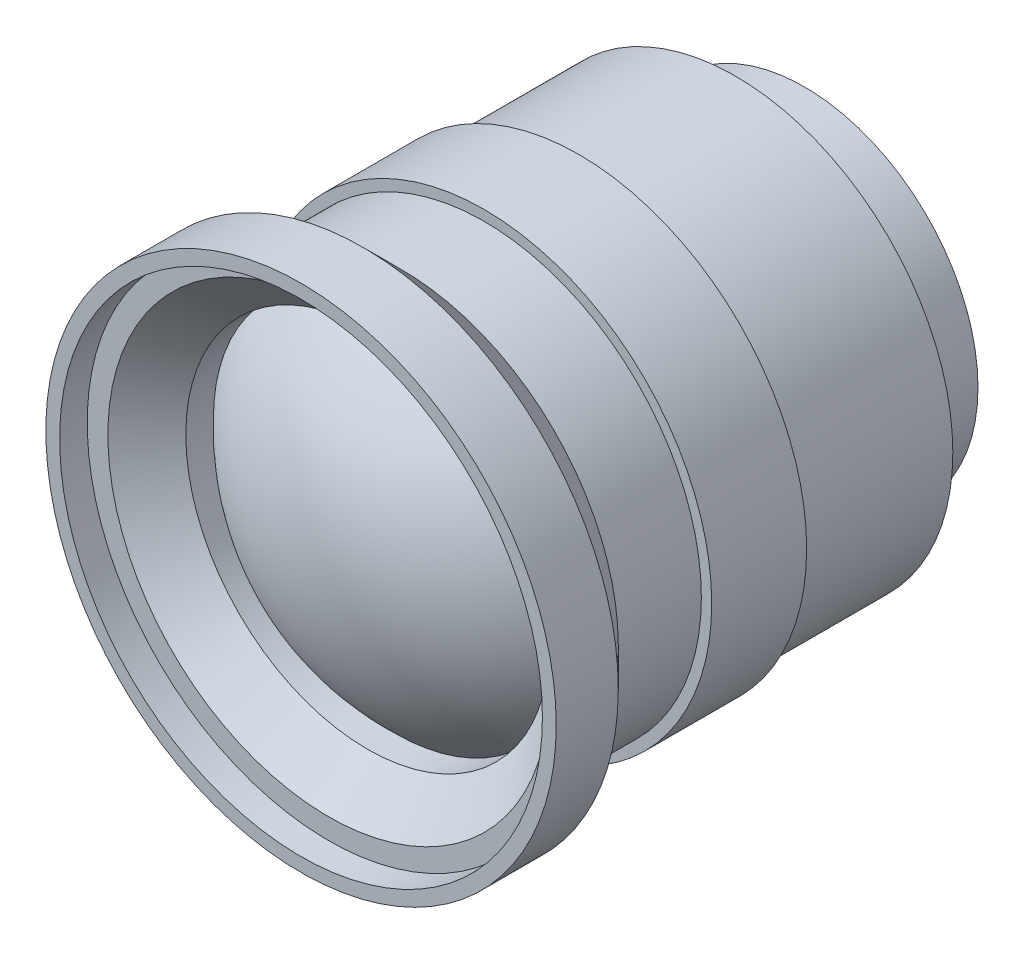
ISO-10303-21;
HEADER;
FILE_DESCRIPTION(('STEP AP214'),'2;1');
FILE_NAME('part.step','',(''),(''),'','','');
FILE_SCHEMA(('AUTOMOTIVE_DESIGN { 1 0 10303 214 1 1 1 1 }'));
ENDSEC;
DATA;
#1=APPLICATION_CONTEXT('core data for automotive mechanical design processes');
#2=APPLICATION_PROTOCOL_DEFINITION('international standard','automotive_design',2000,#1);
#3=PRODUCT_CONTEXT('',#1,'mechanical');
#4=PRODUCT('Part','Part','',(#3));
#5=PRODUCT_RELATED_PRODUCT_CATEGORY('part','',(#4));
#6=PRODUCT_DEFINITION_FORMATION('','',#4);
#7=PRODUCT_DEFINITION_CONTEXT('part definition',#1,'design');
#8=PRODUCT_DEFINITION('design','',#6,#7);
#9=PRODUCT_DEFINITION_SHAPE('','',#8);
#10=(LENGTH_UNIT() NAMED_UNIT(*) SI_UNIT(.MILLI.,.METRE.));
#11=(NAMED_UNIT(*) PLANE_ANGLE_UNIT() SI_UNIT($,.RADIAN.));
#12=(NAMED_UNIT(*) SI_UNIT($,.STERADIAN.) SOLID_ANGLE_UNIT());
#13=UNCERTAINTY_MEASURE_WITH_UNIT(LENGTH_MEASURE(1.E-05),#10,'distance_accuracy_value','');
#14=(GEOMETRIC_REPRESENTATION_CONTEXT(3) GLOBAL_UNCERTAINTY_ASSIGNED_CONTEXT((#13)) GLOBAL_UNIT_ASSIGNED_CONTEXT((#10,
#11,#12)) REPRESENTATION_CONTEXT('',''));
#15=CARTESIAN_POINT('',(0.,0.,0.));
#16=DIRECTION('',(0.,0.,1.));
#17=DIRECTION('',(1.,0.,0.));
#18=AXIS2_PLACEMENT_3D('',#15,#16,#17);
#19=CARTESIAN_POINT('',(0.,0.,0.));
#20=DIRECTION('',(0.,0.,1.));
#21=DIRECTION('',(1.,0.,0.));
#22=AXIS2_PLACEMENT_3D('',#19,#20,#21);
#23=PLANE('',#22);
#24=CARTESIAN_POINT('',(0.,0.,0.));
#25=DIRECTION('',(0.,0.,1.));
#26=DIRECTION('',(1.,0.,0.));
#27=AXIS2_PLACEMENT_3D('',#24,#25,#26);
#28=CIRCLE('',#27,12.575);
#29=CARTESIAN_POINT('',(12.575,0.,0.));
#30=VERTEX_POINT('',#29);
#31=EDGE_CURVE('E10',#30,#30,#28,.T.);
#32=ORIENTED_EDGE('',*,*,#31,.F.);
#33=EDGE_LOOP('',(#32));
#34=FACE_BOUND('',#33,.T.);
#35=ADVANCED_FACE('F35',(#34),#23,.F.);
#36=CARTESIAN_POINT('',(0.,0.,35.4613930078287));
#37=DIRECTION('',(0.,0.,1.));
#38=DIRECTION('',(1.,0.,0.));
#39=AXIS2_PLACEMENT_3D('',#36,#37,#38);
#40=CYLINDRICAL_SURFACE('',#39,12.575);
#41=CARTESIAN_POINT('',(0.,0.,5.));
#42=DIRECTION('',(0.,0.,1.));
#43=DIRECTION('',(1.,0.,0.));
#44=AXIS2_PLACEMENT_3D('',#41,#42,#43);
#45=CIRCLE('',#44,12.575);
#46=CARTESIAN_POINT('',(12.575,0.,5.));
#47=VERTEX_POINT('',#46);
#48=EDGE_CURVE('E41',#47,#47,#45,.T.);
#49=ORIENTED_EDGE('',*,*,#48,.F.);
#50=EDGE_LOOP('',(#49));
#51=FACE_BOUND('',#50,.T.);
#52=ORIENTED_EDGE('',*,*,#31,.T.);
#53=EDGE_LOOP('',(#52));
#54=FACE_BOUND('',#53,.T.);
#55=ADVANCED_FACE('F164',(#51,#54),#40,.T.);
#56=CARTESIAN_POINT('',(0.,12.575,5.));
#57=DIRECTION('',(0.,0.,1.));
#58=DIRECTION('',(1.,0.,0.));
#59=AXIS2_PLACEMENT_3D('',#56,#57,#58);
#60=PLANE('',#59);
#61=CARTESIAN_POINT('',(0.,0.,5.));
#62=DIRECTION('',(0.,0.,1.));
#63=DIRECTION('',(1.,0.,0.));
#64=AXIS2_PLACEMENT_3D('',#61,#62,#63);
#65=CIRCLE('',#64,15.75);
#66=CARTESIAN_POINT('',(15.75,0.,5.));
#67=VERTEX_POINT('',#66);
#68=EDGE_CURVE('E45',#67,#67,#65,.T.);
#69=ORIENTED_EDGE('',*,*,#68,.F.);
#70=EDGE_LOOP('',(#69));
#71=FACE_BOUND('',#70,.T.);
#72=ORIENTED_EDGE('',*,*,#48,.T.);
#73=EDGE_LOOP('',(#72));
#74=FACE_BOUND('',#73,.T.);
#75=ADVANCED_FACE('F159',(#71,#74),#60,.F.);
#76=CARTESIAN_POINT('',(0.,0.,35.4613930078287));
#77=DIRECTION('',(0.,0.,1.));
#78=DIRECTION('',(1.,0.,0.));
#79=AXIS2_PLACEMENT_3D('',#76,#77,#78);
#80=CYLINDRICAL_SURFACE('',#79,15.75);
#81=CARTESIAN_POINT('',(0.,0.,16.3454234331637));
#82=DIRECTION('',(0.,0.,1.));
#83=DIRECTION('',(1.,0.,0.));
#84=AXIS2_PLACEMENT_3D('',#81,#82,#83);
#85=CIRCLE('',#84,15.75);
#86=CARTESIAN_POINT('',(15.75,0.,16.3454234331637));
#87=VERTEX_POINT('',#86);
#88=EDGE_CURVE('E49',#87,#87,#85,.T.);
#89=ORIENTED_EDGE('',*,*,#88,.F.);
#90=EDGE_LOOP('',(#89));
#91=FACE_BOUND('',#90,.T.);
#92=ORIENTED_EDGE('',*,*,#68,.T.);
#93=EDGE_LOOP('',(#92));
#94=FACE_BOUND('',#93,.T.);
#95=ADVANCED_FACE('F153',(#91,#94),#80,.T.);
#96=CARTESIAN_POINT('',(0.,15.75,16.3454234331637));
#97=DIRECTION('',(0.,0.,1.));
#98=DIRECTION('',(1.,0.,0.));
#99=AXIS2_PLACEMENT_3D('',#96,#97,#98);
#100=PLANE('',#99);
#101=CARTESIAN_POINT('',(0.,0.,16.3454234331637));
#102=DIRECTION('',(0.,0.,1.));
#103=DIRECTION('',(1.,0.,0.));
#104=AXIS2_PLACEMENT_3D('',#101,#102,#103);
#105=CIRCLE('',#104,16.5);
#106=CARTESIAN_POINT('',(16.5,0.,16.3454234331637));
#107=VERTEX_POINT('',#106);
#108=EDGE_CURVE('E54',#107,#107,#105,.T.);
#109=ORIENTED_EDGE('',*,*,#108,.F.);
#110=EDGE_LOOP('',(#109));
#111=FACE_BOUND('',#110,.T.);
#112=ORIENTED_EDGE('',*,*,#88,.T.);
#113=EDGE_LOOP('',(#112));
#114=FACE_BOUND('',#113,.T.);
#115=ADVANCED_FACE('F147',(#111,#114),#100,.F.);
#116=CARTESIAN_POINT('',(0.,0.,35.4613930078287));
#117=DIRECTION('',(0.,0.,1.));
#118=DIRECTION('',(1.,0.,0.));
#119=AXIS2_PLACEMENT_3D('',#116,#117,#118);
#120=CYLINDRICAL_SURFACE('',#119,16.5);
#121=CARTESIAN_POINT('',(0.,0.,23.228752502532));
#122=DIRECTION('',(0.,0.,1.));
#123=DIRECTION('',(1.,0.,0.));
#124=AXIS2_PLACEMENT_3D('',#121,#122,#123);
#125=CIRCLE('',#124,16.5);
#126=CARTESIAN_POINT('',(16.5,0.,23.228752502532));
#127=VERTEX_POINT('',#126);
#128=EDGE_CURVE('E57',#127,#127,#125,.T.);
#129=ORIENTED_EDGE('',*,*,#128,.F.);
#130=EDGE_LOOP('',(#129));
#131=FACE_BOUND('',#130,.T.);
#132=ORIENTED_EDGE('',*,*,#108,.T.);
#133=EDGE_LOOP('',(#132));
#134=FACE_BOUND('',#133,.T.);
#135=ADVANCED_FACE('F141',(#131,#134),#120,.T.);
#136=CARTESIAN_POINT('',(0.,16.5,23.228752502532));
#137=DIRECTION('',(0.,0.,-1.));
#138=DIRECTION('',(-1.,0.,0.));
#139=AXIS2_PLACEMENT_3D('',#136,#137,#138);
#140=PLANE('',#139);
#141=CARTESIAN_POINT('',(0.,0.,23.228752502532));
#142=DIRECTION('',(0.,0.,1.));
#143=DIRECTION('',(1.,0.,0.));
#144=AXIS2_PLACEMENT_3D('',#141,#142,#143);
#145=CIRCLE('',#144,15.75);
#146=CARTESIAN_POINT('',(15.75,0.,23.228752502532));
#147=VERTEX_POINT('',#146);
#148=EDGE_CURVE('E60',#147,#147,#145,.T.);
#149=ORIENTED_EDGE('',*,*,#148,.F.);
#150=EDGE_LOOP('',(#149));
#151=FACE_BOUND('',#150,.T.);
#152=ORIENTED_EDGE('',*,*,#128,.T.);
#153=EDGE_LOOP('',(#152));
#154=FACE_BOUND('',#153,.T.);
#155=ADVANCED_FACE('F135',(#151,#154),#140,.F.);
#156=CARTESIAN_POINT('',(0.,0.,35.4613930078287));
#157=DIRECTION('',(0.,0.,1.));
#158=DIRECTION('',(1.,0.,0.));
#159=AXIS2_PLACEMENT_3D('',#156,#157,#158);
#160=CYLINDRICAL_SURFACE('',#159,15.75);
#161=CARTESIAN_POINT('',(0.,0.,29.2516654382292));
#162=DIRECTION('',(0.,0.,1.));
#163=DIRECTION('',(1.,0.,0.));
#164=AXIS2_PLACEMENT_3D('',#161,#162,#163);
#165=CIRCLE('',#164,15.75);
#166=CARTESIAN_POINT('',(15.75,0.,29.2516654382292));
#167=VERTEX_POINT('',#166);
#168=EDGE_CURVE('E63',#167,#167,#165,.T.);
#169=ORIENTED_EDGE('',*,*,#168,.F.);
#170=EDGE_LOOP('',(#169));
#171=FACE_BOUND('',#170,.T.);
#172=ORIENTED_EDGE('',*,*,#148,.T.);
#173=EDGE_LOOP('',(#172));
#174=FACE_BOUND('',#173,.T.);
#175=ADVANCED_FACE('F129',(#171,#174),#160,.T.);
#176=CARTESIAN_POINT('',(0.,0.,29.2516654382292));
#177=DIRECTION('',(0.,0.,1.));
#178=DIRECTION('',(1.,0.,0.));
#179=AXIS2_PLACEMENT_3D('',#176,#177,#178);
#180=CONICAL_SURFACE('',#179,15.75,0.78539816339745);
#181=CARTESIAN_POINT('',(0.,0.,32.0016654382292));
#182=DIRECTION('',(0.,0.,1.));
#183=DIRECTION('',(1.,0.,0.));
#184=AXIS2_PLACEMENT_3D('',#181,#182,#183);
#185=CIRCLE('',#184,18.5);
#186=CARTESIAN_POINT('',(18.5,0.,32.0016654382292));
#187=VERTEX_POINT('',#186);
#188=EDGE_CURVE('E66',#187,#187,#185,.T.);
#189=ORIENTED_EDGE('',*,*,#188,.F.);
#190=EDGE_LOOP('',(#189));
#191=FACE_BOUND('',#190,.T.);
#192=ORIENTED_EDGE('',*,*,#168,.T.);
#193=EDGE_LOOP('',(#192));
#194=FACE_BOUND('',#193,.T.);
#195=ADVANCED_FACE('F123',(#191,#194),#180,.T.);
#196=CARTESIAN_POINT('',(0.,0.,35.4613930078287));
#197=DIRECTION('',(0.,0.,1.));
#198=DIRECTION('',(1.,0.,0.));
#199=AXIS2_PLACEMENT_3D('',#196,#197,#198);
#200=CYLINDRICAL_SURFACE('',#199,18.5);
#201=CARTESIAN_POINT('',(0.,0.,36.5));
#202=DIRECTION('',(0.,0.,1.));
#203=DIRECTION('',(1.,0.,0.));
#204=AXIS2_PLACEMENT_3D('',#201,#202,#203);
#205=CIRCLE('',#204,18.5);
#206=CARTESIAN_POINT('',(18.5,0.,36.5));
#207=VERTEX_POINT('',#206);
#208=EDGE_CURVE('E69',#207,#207,#205,.T.);
#209=ORIENTED_EDGE('',*,*,#208,.F.);
#210=EDGE_LOOP('',(#209));
#211=FACE_BOUND('',#210,.T.);
#212=ORIENTED_EDGE('',*,*,#188,.T.);
#213=EDGE_LOOP('',(#212));
#214=FACE_BOUND('',#213,.T.);
#215=ADVANCED_FACE('F117',(#211,#214),#200,.T.);
#216=CARTESIAN_POINT('',(0.,18.5,36.5));
#217=DIRECTION('',(0.,0.,-1.));
#218=DIRECTION('',(-1.,0.,0.));
#219=AXIS2_PLACEMENT_3D('',#216,#217,#218);
#220=PLANE('',#219);
#221=CARTESIAN_POINT('',(0.,0.,36.5));
#222=DIRECTION('',(0.,0.,1.));
#223=DIRECTION('',(1.,0.,0.));
#224=AXIS2_PLACEMENT_3D('',#221,#222,#223);
#225=CIRCLE('',#224,17.5);
#226=CARTESIAN_POINT('',(17.5,0.,36.5));
#227=VERTEX_POINT('',#226);
#228=EDGE_CURVE('E72',#227,#227,#225,.T.);
#229=ORIENTED_EDGE('',*,*,#228,.F.);
#230=EDGE_LOOP('',(#229));
#231=FACE_BOUND('',#230,.T.);
#232=ORIENTED_EDGE('',*,*,#208,.T.);
#233=EDGE_LOOP('',(#232));
#234=FACE_BOUND('',#233,.T.);
#235=ADVANCED_FACE('F111',(#231,#234),#220,.F.);
#236=CARTESIAN_POINT('',(0.,0.,35.4613930078287));
#237=DIRECTION('',(0.,0.,1.));
#238=DIRECTION('',(1.,0.,0.));
#239=AXIS2_PLACEMENT_3D('',#236,#237,#238);
#240=CYLINDRICAL_SURFACE('',#239,17.5);
#241=CARTESIAN_POINT('',(0.,0.,34.5));
#242=DIRECTION('',(0.,0.,1.));
#243=DIRECTION('',(1.,0.,0.));
#244=AXIS2_PLACEMENT_3D('',#241,#242,#243);
#245=CIRCLE('',#244,17.5);
#246=CARTESIAN_POINT('',(17.5,0.,34.5));
#247=VERTEX_POINT('',#246);
#248=EDGE_CURVE('E75',#247,#247,#245,.T.);
#249=ORIENTED_EDGE('',*,*,#248,.F.);
#250=EDGE_LOOP('',(#249));
#251=FACE_BOUND('',#250,.T.);
#252=ORIENTED_EDGE('',*,*,#228,.T.);
#253=EDGE_LOOP('',(#252));
#254=FACE_BOUND('',#253,.T.);
#255=ADVANCED_FACE('F105',(#251,#254),#240,.F.);
#256=CARTESIAN_POINT('',(0.,17.5,34.5));
#257=DIRECTION('',(0.,0.,-1.));
#258=DIRECTION('',(-1.,0.,0.));
#259=AXIS2_PLACEMENT_3D('',#256,#257,#258);
#260=PLANE('',#259);
#261=CARTESIAN_POINT('',(0.,0.,34.5));
#262=DIRECTION('',(0.,0.,1.));
#263=DIRECTION('',(1.,0.,0.));
#264=AXIS2_PLACEMENT_3D('',#261,#262,#263);
#265=CIRCLE('',#264,16.);
#266=CARTESIAN_POINT('',(16.,0.,34.5));
#267=VERTEX_POINT('',#266);
#268=EDGE_CURVE('E78',#267,#267,#265,.T.);
#269=ORIENTED_EDGE('',*,*,#268,.F.);
#270=EDGE_LOOP('',(#269));
#271=FACE_BOUND('',#270,.T.);
#272=ORIENTED_EDGE('',*,*,#248,.T.);
#273=EDGE_LOOP('',(#272));
#274=FACE_BOUND('',#273,.T.);
#275=ADVANCED_FACE('F99',(#271,#274),#260,.F.);
#276=CARTESIAN_POINT('',(0.,0.,34.5));
#277=DIRECTION('',(0.,0.,1.));
#278=DIRECTION('',(1.,0.,0.));
#279=AXIS2_PLACEMENT_3D('',#276,#277,#278);
#280=CONICAL_SURFACE('',#279,16.,0.78539816339745);
#281=CARTESIAN_POINT('',(0.,0.,31.6760379405644));
#282=DIRECTION('',(0.,0.,1.));
#283=DIRECTION('',(1.,0.,0.));
#284=AXIS2_PLACEMENT_3D('',#281,#282,#283);
#285=CIRCLE('',#284,13.1760379405644);
#286=CARTESIAN_POINT('',(13.1760379405644,0.,31.6760379405644));
#287=VERTEX_POINT('',#286);
#288=EDGE_CURVE('E81',#287,#287,#285,.T.);
#289=ORIENTED_EDGE('',*,*,#288,.F.);
#290=EDGE_LOOP('',(#289));
#291=FACE_BOUND('',#290,.T.);
#292=ORIENTED_EDGE('',*,*,#268,.T.);
#293=EDGE_LOOP('',(#292));
#294=FACE_BOUND('',#293,.T.);
#295=ADVANCED_FACE('F93',(#291,#294),#280,.F.);
#296=CARTESIAN_POINT('',(0.,0.,35.4613930078287));
#297=DIRECTION('',(0.,0.,1.));
#298=DIRECTION('',(1.,0.,0.));
#299=AXIS2_PLACEMENT_3D('',#296,#297,#298);
#300=CYLINDRICAL_SURFACE('',#299,13.1760379405644);
#301=CARTESIAN_POINT('',(0.,0.,29.6760379405644));
#302=DIRECTION('',(0.,0.,1.));
#303=DIRECTION('',(1.,0.,0.));
#304=AXIS2_PLACEMENT_3D('',#301,#302,#303);
#305=CIRCLE('',#304,13.1760379405644);
#306=CARTESIAN_POINT('',(13.1760379405644,0.,29.6760379405644));
#307=VERTEX_POINT('',#306);
#308=EDGE_CURVE('E84',#307,#307,#305,.T.);
#309=ORIENTED_EDGE('',*,*,#308,.F.);
#310=EDGE_LOOP('',(#309));
#311=FACE_BOUND('',#310,.T.);
#312=ORIENTED_EDGE('',*,*,#288,.T.);
#313=EDGE_LOOP('',(#312));
#314=FACE_BOUND('',#313,.T.);
#315=ADVANCED_FACE('F90',(#311,#314),#300,.F.);
#316=CARTESIAN_POINT('',(0.,0.,17.5646255097333));
#317=DIRECTION('',(0.,0.,1.));
#318=DIRECTION('',(0.,1.,0.));
#319=AXIS2_PLACEMENT_3D('',#316,#317,#318);
#320=SPHERICAL_SURFACE('',#319,17.8967674980954);
#321=ORIENTED_EDGE('',*,*,#308,.T.);
#322=EDGE_LOOP('',(#321));
#323=FACE_BOUND('',#322,.T.);
#324=ADVANCED_FACE('F88',(#323),#320,.T.);
#325=CLOSED_SHELL('',(#35,#55,#75,#95,#115,#135,#155,#175,#195,#215,#235,#255,#275,#295,#315,#324));
#326=MANIFOLD_SOLID_BREP('B2',#325);
#327=ADVANCED_BREP_SHAPE_REPRESENTATION('',(#18,#326),#14);
#328=SHAPE_DEFINITION_REPRESENTATION(#9,#327);
ENDSEC;
END-ISO-10303-21;
